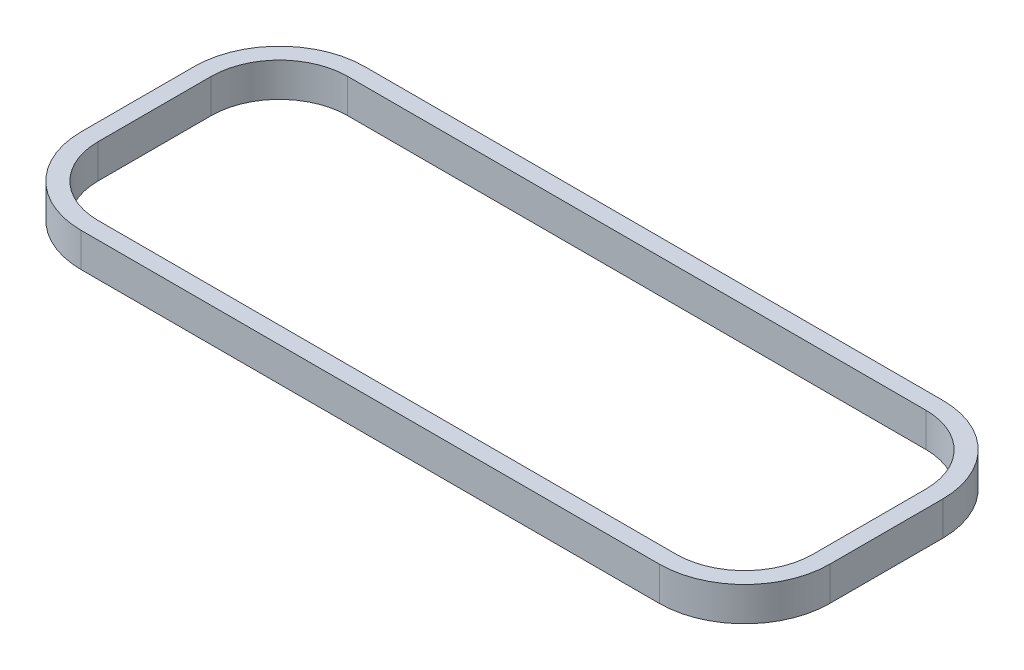
ISO-10303-21;
HEADER;
FILE_DESCRIPTION(('STEP AP214'),'2;1');
FILE_NAME('part.step','',(''),(''),'','','');
FILE_SCHEMA(('AUTOMOTIVE_DESIGN { 1 0 10303 214 1 1 1 1 }'));
ENDSEC;
DATA;
#1=APPLICATION_CONTEXT('core data for automotive mechanical design processes');
#2=APPLICATION_PROTOCOL_DEFINITION('international standard','automotive_design',2000,#1);
#3=PRODUCT_CONTEXT('',#1,'mechanical');
#4=PRODUCT('Part','Part','',(#3));
#5=PRODUCT_RELATED_PRODUCT_CATEGORY('part','',(#4));
#6=PRODUCT_DEFINITION_FORMATION('','',#4);
#7=PRODUCT_DEFINITION_CONTEXT('part definition',#1,'design');
#8=PRODUCT_DEFINITION('design','',#6,#7);
#9=PRODUCT_DEFINITION_SHAPE('','',#8);
#10=(LENGTH_UNIT() NAMED_UNIT(*) SI_UNIT(.MILLI.,.METRE.));
#11=(NAMED_UNIT(*) PLANE_ANGLE_UNIT() SI_UNIT($,.RADIAN.));
#12=(NAMED_UNIT(*) SI_UNIT($,.STERADIAN.) SOLID_ANGLE_UNIT());
#13=UNCERTAINTY_MEASURE_WITH_UNIT(LENGTH_MEASURE(1.E-05),#10,'distance_accuracy_value','');
#14=(GEOMETRIC_REPRESENTATION_CONTEXT(3) GLOBAL_UNCERTAINTY_ASSIGNED_CONTEXT((#13)) GLOBAL_UNIT_ASSIGNED_CONTEXT((#10,
#11,#12)) REPRESENTATION_CONTEXT('',''));
#15=CARTESIAN_POINT('',(0.,0.,0.));
#16=DIRECTION('',(0.,0.,1.));
#17=DIRECTION('',(1.,0.,0.));
#18=AXIS2_PLACEMENT_3D('',#15,#16,#17);
#19=CARTESIAN_POINT('',(-113.664063287363,19.05,-5.18142409919167));
#20=DIRECTION('',(0.,-1.,0.));
#21=DIRECTION('',(0.,0.,-1.));
#22=AXIS2_PLACEMENT_3D('',#19,#20,#21);
#23=PLANE('',#22);
#24=CARTESIAN_POINT('',(-113.664063287363,19.05,-5.18142409919167));
#25=DIRECTION('',(0.,1.,0.));
#26=DIRECTION('',(0.,0.,-1.));
#27=AXIS2_PLACEMENT_3D('',#24,#25,#26);
#28=CIRCLE('',#27,47.752);
#29=CARTESIAN_POINT('',(-113.664063287363,19.05,-52.9334240991916));
#30=VERTEX_POINT('',#29);
#31=CARTESIAN_POINT('',(-161.416063287363,19.05,-5.18142409919167));
#32=VERTEX_POINT('',#31);
#33=EDGE_CURVE('E213',#30,#32,#28,.T.);
#34=ORIENTED_EDGE('',*,*,#33,.T.);
#35=DIRECTION('',(0.,0.,1.));
#36=VECTOR('',#35,1.);
#37=CARTESIAN_POINT('',(-161.416063287363,19.05,-5.18142409919167));
#38=LINE('',#37,#36);
#39=CARTESIAN_POINT('',(-161.416063287363,19.05,58.0645759008083));
#40=VERTEX_POINT('',#39);
#41=EDGE_CURVE('E216',#32,#40,#38,.T.);
#42=ORIENTED_EDGE('',*,*,#41,.T.);
#43=CARTESIAN_POINT('',(-113.664063287363,19.05,58.0645759008084));
#44=DIRECTION('',(0.,1.,0.));
#45=DIRECTION('',(0.,0.,1.));
#46=AXIS2_PLACEMENT_3D('',#43,#44,#45);
#47=CIRCLE('',#46,47.752);
#48=CARTESIAN_POINT('',(-113.664063287363,19.05,105.816575900808));
#49=VERTEX_POINT('',#48);
#50=EDGE_CURVE('E219',#40,#49,#47,.T.);
#51=ORIENTED_EDGE('',*,*,#50,.T.);
#52=DIRECTION('',(1.,0.,0.));
#53=VECTOR('',#52,1.);
#54=CARTESIAN_POINT('',(-113.664063287363,19.05,105.816575900808));
#55=LINE('',#54,#53);
#56=CARTESIAN_POINT('',(209.931936712637,19.05,105.816575900808));
#57=VERTEX_POINT('',#56);
#58=EDGE_CURVE('E221',#49,#57,#55,.T.);
#59=ORIENTED_EDGE('',*,*,#58,.T.);
#60=CARTESIAN_POINT('',(209.931936712637,19.05,58.0645759008083));
#61=DIRECTION('',(0.,1.,0.));
#62=DIRECTION('',(0.,0.,1.));
#63=AXIS2_PLACEMENT_3D('',#60,#61,#62);
#64=CIRCLE('',#63,47.752);
#65=CARTESIAN_POINT('',(257.683936712637,19.05,58.0645759008083));
#66=VERTEX_POINT('',#65);
#67=EDGE_CURVE('E223',#57,#66,#64,.T.);
#68=ORIENTED_EDGE('',*,*,#67,.T.);
#69=DIRECTION('',(0.,0.,-1.));
#70=VECTOR('',#69,1.);
#71=CARTESIAN_POINT('',(257.683936712637,19.05,58.0645759008083));
#72=LINE('',#71,#70);
#73=CARTESIAN_POINT('',(257.683936712636,19.05,-5.18142409919173));
#74=VERTEX_POINT('',#73);
#75=EDGE_CURVE('E225',#66,#74,#72,.T.);
#76=ORIENTED_EDGE('',*,*,#75,.T.);
#77=CARTESIAN_POINT('',(209.931936712636,19.05,-5.1814240991917));
#78=DIRECTION('',(0.,1.,0.));
#79=DIRECTION('',(0.,0.,1.));
#80=AXIS2_PLACEMENT_3D('',#77,#78,#79);
#81=CIRCLE('',#80,47.752);
#82=CARTESIAN_POINT('',(209.931936712636,19.05,-52.9334240991917));
#83=VERTEX_POINT('',#82);
#84=EDGE_CURVE('E227',#74,#83,#81,.T.);
#85=ORIENTED_EDGE('',*,*,#84,.T.);
#86=DIRECTION('',(-1.,0.,0.));
#87=VECTOR('',#86,1.);
#88=CARTESIAN_POINT('',(209.931936712636,19.05,-52.9334240991917));
#89=LINE('',#88,#87);
#90=EDGE_CURVE('E229',#83,#30,#89,.T.);
#91=ORIENTED_EDGE('',*,*,#90,.T.);
#92=EDGE_LOOP('',(#34,#42,#51,#59,#68,#76,#85,#91));
#93=FACE_BOUND('',#92,.T.);
#94=CARTESIAN_POINT('',(-113.664063287363,19.05,-5.18142409919166));
#95=DIRECTION('',(0.,1.,0.));
#96=DIRECTION('',(0.,0.,1.));
#97=AXIS2_PLACEMENT_3D('',#94,#95,#96);
#98=CIRCLE('',#97,38.227);
#99=CARTESIAN_POINT('',(-113.664063287363,19.05,-43.4084240991916));
#100=VERTEX_POINT('',#99);
#101=CARTESIAN_POINT('',(-151.891063287363,19.05,-5.18142409919167));
#102=VERTEX_POINT('',#101);
#103=EDGE_CURVE('E148',#100,#102,#98,.T.);
#104=ORIENTED_EDGE('',*,*,#103,.F.);
#105=DIRECTION('',(-1.,0.,0.));
#106=VECTOR('',#105,1.);
#107=CARTESIAN_POINT('',(209.931936712636,19.05,-43.4084240991917));
#108=LINE('',#107,#106);
#109=CARTESIAN_POINT('',(209.931936712637,19.05,-43.4084240991917));
#110=VERTEX_POINT('',#109);
#111=EDGE_CURVE('E181',#110,#100,#108,.T.);
#112=ORIENTED_EDGE('',*,*,#111,.F.);
#113=CARTESIAN_POINT('',(209.931936712636,19.05,-5.1814240991917));
#114=DIRECTION('',(0.,1.,0.));
#115=DIRECTION('',(0.,0.,1.));
#116=AXIS2_PLACEMENT_3D('',#113,#114,#115);
#117=CIRCLE('',#116,38.227);
#118=CARTESIAN_POINT('',(248.158936712636,19.05,-5.18142409919172));
#119=VERTEX_POINT('',#118);
#120=EDGE_CURVE('E179',#119,#110,#117,.T.);
#121=ORIENTED_EDGE('',*,*,#120,.F.);
#122=DIRECTION('',(0.,0.,-1.));
#123=VECTOR('',#122,1.);
#124=CARTESIAN_POINT('',(248.158936712636,19.05,58.0645759008083));
#125=LINE('',#124,#123);
#126=CARTESIAN_POINT('',(248.158936712637,19.05,58.0645759008083));
#127=VERTEX_POINT('',#126);
#128=EDGE_CURVE('E177',#127,#119,#125,.T.);
#129=ORIENTED_EDGE('',*,*,#128,.F.);
#130=CARTESIAN_POINT('',(209.931936712637,19.05,58.0645759008083));
#131=DIRECTION('',(0.,1.,0.));
#132=DIRECTION('',(0.,0.,1.));
#133=AXIS2_PLACEMENT_3D('',#130,#131,#132);
#134=CIRCLE('',#133,38.227);
#135=CARTESIAN_POINT('',(209.931936712637,19.05,96.2915759008083));
#136=VERTEX_POINT('',#135);
#137=EDGE_CURVE('E175',#136,#127,#134,.T.);
#138=ORIENTED_EDGE('',*,*,#137,.F.);
#139=DIRECTION('',(1.,0.,0.));
#140=VECTOR('',#139,1.);
#141=CARTESIAN_POINT('',(-113.664063287363,19.05,96.2915759008084));
#142=LINE('',#141,#140);
#143=CARTESIAN_POINT('',(-113.664063287363,19.05,96.2915759008083));
#144=VERTEX_POINT('',#143);
#145=EDGE_CURVE('E171',#144,#136,#142,.T.);
#146=ORIENTED_EDGE('',*,*,#145,.F.);
#147=CARTESIAN_POINT('',(-113.664063287363,19.05,58.0645759008084));
#148=DIRECTION('',(0.,1.,0.));
#149=DIRECTION('',(0.,0.,1.));
#150=AXIS2_PLACEMENT_3D('',#147,#148,#149);
#151=CIRCLE('',#150,38.227);
#152=CARTESIAN_POINT('',(-151.891063287363,19.05,58.0645759008083));
#153=VERTEX_POINT('',#152);
#154=EDGE_CURVE('E169',#153,#144,#151,.T.);
#155=ORIENTED_EDGE('',*,*,#154,.F.);
#156=DIRECTION('',(0.,0.,1.));
#157=VECTOR('',#156,1.);
#158=CARTESIAN_POINT('',(-151.891063287363,19.05,-5.18142409919167));
#159=LINE('',#158,#157);
#160=EDGE_CURVE('E156',#102,#153,#159,.T.);
#161=ORIENTED_EDGE('',*,*,#160,.F.);
#162=EDGE_LOOP('',(#104,#112,#121,#129,#138,#146,#155,#161));
#163=FACE_BOUND('',#162,.T.);
#164=ADVANCED_FACE('F35',(#93,#163),#23,.F.);
#165=CARTESIAN_POINT('',(-113.664063287363,0.,-5.18142409919167));
#166=DIRECTION('',(0.,-1.,0.));
#167=DIRECTION('',(0.,0.,-1.));
#168=AXIS2_PLACEMENT_3D('',#165,#166,#167);
#169=PLANE('',#168);
#170=CARTESIAN_POINT('',(-113.664063287363,0.,-5.18142409919167));
#171=DIRECTION('',(0.,1.,0.));
#172=DIRECTION('',(0.,0.,-1.));
#173=AXIS2_PLACEMENT_3D('',#170,#171,#172);
#174=CIRCLE('',#173,47.752);
#175=CARTESIAN_POINT('',(-113.664063287363,0.,-52.9334240991916));
#176=VERTEX_POINT('',#175);
#177=CARTESIAN_POINT('',(-161.416063287363,0.,-5.18142409919167));
#178=VERTEX_POINT('',#177);
#179=EDGE_CURVE('E164',#176,#178,#174,.T.);
#180=ORIENTED_EDGE('',*,*,#179,.F.);
#181=DIRECTION('',(-1.,0.,0.));
#182=VECTOR('',#181,1.);
#183=CARTESIAN_POINT('',(209.931936712636,0.,-52.9334240991917));
#184=LINE('',#183,#182);
#185=CARTESIAN_POINT('',(209.931936712636,0.,-52.9334240991917));
#186=VERTEX_POINT('',#185);
#187=EDGE_CURVE('E217',#186,#176,#184,.T.);
#188=ORIENTED_EDGE('',*,*,#187,.F.);
#189=CARTESIAN_POINT('',(209.931936712636,0.,-5.1814240991917));
#190=DIRECTION('',(0.,1.,0.));
#191=DIRECTION('',(0.,0.,1.));
#192=AXIS2_PLACEMENT_3D('',#189,#190,#191);
#193=CIRCLE('',#192,47.752);
#194=CARTESIAN_POINT('',(257.683936712636,0.,-5.18142409919173));
#195=VERTEX_POINT('',#194);
#196=EDGE_CURVE('E244',#195,#186,#193,.T.);
#197=ORIENTED_EDGE('',*,*,#196,.F.);
#198=DIRECTION('',(0.,0.,-1.));
#199=VECTOR('',#198,1.);
#200=CARTESIAN_POINT('',(257.683936712637,0.,58.0645759008083));
#201=LINE('',#200,#199);
#202=CARTESIAN_POINT('',(257.683936712637,0.,58.0645759008083));
#203=VERTEX_POINT('',#202);
#204=EDGE_CURVE('E242',#203,#195,#201,.T.);
#205=ORIENTED_EDGE('',*,*,#204,.F.);
#206=CARTESIAN_POINT('',(209.931936712637,0.,58.0645759008083));
#207=DIRECTION('',(0.,1.,0.));
#208=DIRECTION('',(0.,0.,1.));
#209=AXIS2_PLACEMENT_3D('',#206,#207,#208);
#210=CIRCLE('',#209,47.752);
#211=CARTESIAN_POINT('',(209.931936712637,0.,105.816575900808));
#212=VERTEX_POINT('',#211);
#213=EDGE_CURVE('E240',#212,#203,#210,.T.);
#214=ORIENTED_EDGE('',*,*,#213,.F.);
#215=DIRECTION('',(1.,0.,0.));
#216=VECTOR('',#215,1.);
#217=CARTESIAN_POINT('',(-113.664063287363,0.,105.816575900808));
#218=LINE('',#217,#216);
#219=CARTESIAN_POINT('',(-113.664063287363,0.,105.816575900808));
#220=VERTEX_POINT('',#219);
#221=EDGE_CURVE('E238',#220,#212,#218,.T.);
#222=ORIENTED_EDGE('',*,*,#221,.F.);
#223=CARTESIAN_POINT('',(-113.664063287363,0.,58.0645759008084));
#224=DIRECTION('',(0.,1.,0.));
#225=DIRECTION('',(0.,0.,1.));
#226=AXIS2_PLACEMENT_3D('',#223,#224,#225);
#227=CIRCLE('',#226,47.752);
#228=CARTESIAN_POINT('',(-161.416063287363,0.,58.0645759008083));
#229=VERTEX_POINT('',#228);
#230=EDGE_CURVE('E236',#229,#220,#227,.T.);
#231=ORIENTED_EDGE('',*,*,#230,.F.);
#232=DIRECTION('',(0.,0.,1.));
#233=VECTOR('',#232,1.);
#234=CARTESIAN_POINT('',(-161.416063287363,0.,-5.18142409919167));
#235=LINE('',#234,#233);
#236=EDGE_CURVE('E234',#178,#229,#235,.T.);
#237=ORIENTED_EDGE('',*,*,#236,.F.);
#238=EDGE_LOOP('',(#180,#188,#197,#205,#214,#222,#231,#237));
#239=FACE_BOUND('',#238,.T.);
#240=DIRECTION('',(-1.,0.,0.));
#241=VECTOR('',#240,1.);
#242=CARTESIAN_POINT('',(209.931936712636,0.,-43.4084240991917));
#243=LINE('',#242,#241);
#244=CARTESIAN_POINT('',(209.931936712636,0.,-43.4084240991917));
#245=VERTEX_POINT('',#244);
#246=CARTESIAN_POINT('',(-113.664063287363,0.,-43.4084240991916));
#247=VERTEX_POINT('',#246);
#248=EDGE_CURVE('E157',#245,#247,#243,.T.);
#249=ORIENTED_EDGE('',*,*,#248,.T.);
#250=CARTESIAN_POINT('',(-113.664063287363,0.,-5.18142409919166));
#251=DIRECTION('',(0.,1.,0.));
#252=DIRECTION('',(0.,0.,1.));
#253=AXIS2_PLACEMENT_3D('',#250,#251,#252);
#254=CIRCLE('',#253,38.227);
#255=CARTESIAN_POINT('',(-151.891063287363,0.,-5.18142409919167));
#256=VERTEX_POINT('',#255);
#257=EDGE_CURVE('E58',#247,#256,#254,.T.);
#258=ORIENTED_EDGE('',*,*,#257,.T.);
#259=DIRECTION('',(0.,0.,1.));
#260=VECTOR('',#259,1.);
#261=CARTESIAN_POINT('',(-151.891063287363,0.,-5.18142409919167));
#262=LINE('',#261,#260);
#263=CARTESIAN_POINT('',(-151.891063287363,0.,58.0645759008083));
#264=VERTEX_POINT('',#263);
#265=EDGE_CURVE('E163',#256,#264,#262,.T.);
#266=ORIENTED_EDGE('',*,*,#265,.T.);
#267=CARTESIAN_POINT('',(-113.664063287363,0.,58.0645759008084));
#268=DIRECTION('',(0.,1.,0.));
#269=DIRECTION('',(0.,0.,1.));
#270=AXIS2_PLACEMENT_3D('',#267,#268,#269);
#271=CIRCLE('',#270,38.227);
#272=CARTESIAN_POINT('',(-113.664063287363,0.,96.2915759008083));
#273=VERTEX_POINT('',#272);
#274=EDGE_CURVE('E185',#264,#273,#271,.T.);
#275=ORIENTED_EDGE('',*,*,#274,.T.);
#276=DIRECTION('',(1.,0.,0.));
#277=VECTOR('',#276,1.);
#278=CARTESIAN_POINT('',(-113.664063287363,0.,96.2915759008084));
#279=LINE('',#278,#277);
#280=CARTESIAN_POINT('',(209.931936712637,0.,96.2915759008083));
#281=VERTEX_POINT('',#280);
#282=EDGE_CURVE('E188',#273,#281,#279,.T.);
#283=ORIENTED_EDGE('',*,*,#282,.T.);
#284=CARTESIAN_POINT('',(209.931936712637,0.,58.0645759008083));
#285=DIRECTION('',(0.,1.,0.));
#286=DIRECTION('',(0.,0.,1.));
#287=AXIS2_PLACEMENT_3D('',#284,#285,#286);
#288=CIRCLE('',#287,38.227);
#289=CARTESIAN_POINT('',(248.158936712637,0.,58.0645759008083));
#290=VERTEX_POINT('',#289);
#291=EDGE_CURVE('E191',#281,#290,#288,.T.);
#292=ORIENTED_EDGE('',*,*,#291,.T.);
#293=DIRECTION('',(0.,0.,-1.));
#294=VECTOR('',#293,1.);
#295=CARTESIAN_POINT('',(248.158936712636,0.,58.0645759008083));
#296=LINE('',#295,#294);
#297=CARTESIAN_POINT('',(248.158936712636,0.,-5.18142409919172));
#298=VERTEX_POINT('',#297);
#299=EDGE_CURVE('E194',#290,#298,#296,.T.);
#300=ORIENTED_EDGE('',*,*,#299,.T.);
#301=CARTESIAN_POINT('',(209.931936712636,0.,-5.1814240991917));
#302=DIRECTION('',(0.,1.,0.));
#303=DIRECTION('',(0.,0.,1.));
#304=AXIS2_PLACEMENT_3D('',#301,#302,#303);
#305=CIRCLE('',#304,38.227);
#306=EDGE_CURVE('E197',#298,#245,#305,.T.);
#307=ORIENTED_EDGE('',*,*,#306,.T.);
#308=EDGE_LOOP('',(#249,#258,#266,#275,#283,#292,#300,#307));
#309=FACE_BOUND('',#308,.T.);
#310=ADVANCED_FACE('F274',(#239,#309),#169,.T.);
#311=CARTESIAN_POINT('',(-113.664063287363,19.05,-5.18142409919167));
#312=DIRECTION('',(0.,-1.,0.));
#313=DIRECTION('',(0.,0.,-1.));
#314=AXIS2_PLACEMENT_3D('',#311,#312,#313);
#315=CYLINDRICAL_SURFACE('',#314,47.752);
#316=ORIENTED_EDGE('',*,*,#179,.T.);
#317=DIRECTION('',(0.,-1.,0.));
#318=VECTOR('',#317,1.);
#319=CARTESIAN_POINT('',(-161.416063287363,19.05,-5.18142409919167));
#320=LINE('',#319,#318);
#321=EDGE_CURVE('E11',#32,#178,#320,.T.);
#322=ORIENTED_EDGE('',*,*,#321,.F.);
#323=ORIENTED_EDGE('',*,*,#33,.F.);
#324=DIRECTION('',(0.,-1.,0.));
#325=VECTOR('',#324,1.);
#326=CARTESIAN_POINT('',(-113.664063287363,19.05,-52.9334240991916));
#327=LINE('',#326,#325);
#328=EDGE_CURVE('E231',#30,#176,#327,.T.);
#329=ORIENTED_EDGE('',*,*,#328,.T.);
#330=EDGE_LOOP('',(#316,#322,#323,#329));
#331=FACE_BOUND('',#330,.T.);
#332=ADVANCED_FACE('F37',(#331),#315,.T.);
#333=CARTESIAN_POINT('',(-161.416063287363,19.05,-5.18142409919167));
#334=DIRECTION('',(1.,0.,0.));
#335=DIRECTION('',(0.,0.,-1.));
#336=AXIS2_PLACEMENT_3D('',#333,#334,#335);
#337=PLANE('',#336);
#338=ORIENTED_EDGE('',*,*,#236,.T.);
#339=DIRECTION('',(0.,-1.,0.));
#340=VECTOR('',#339,1.);
#341=CARTESIAN_POINT('',(-161.416063287363,19.05,58.0645759008083));
#342=LINE('',#341,#340);
#343=EDGE_CURVE('E43',#40,#229,#342,.T.);
#344=ORIENTED_EDGE('',*,*,#343,.F.);
#345=ORIENTED_EDGE('',*,*,#41,.F.);
#346=ORIENTED_EDGE('',*,*,#321,.T.);
#347=EDGE_LOOP('',(#338,#344,#345,#346));
#348=FACE_BOUND('',#347,.T.);
#349=ADVANCED_FACE('F291',(#348),#337,.F.);
#350=CARTESIAN_POINT('',(-113.664063287363,19.05,58.0645759008084));
#351=DIRECTION('',(0.,-1.,0.));
#352=DIRECTION('',(0.,0.,-1.));
#353=AXIS2_PLACEMENT_3D('',#350,#351,#352);
#354=CYLINDRICAL_SURFACE('',#353,47.752);
#355=ORIENTED_EDGE('',*,*,#230,.T.);
#356=DIRECTION('',(0.,-1.,0.));
#357=VECTOR('',#356,1.);
#358=CARTESIAN_POINT('',(-113.664063287363,19.05,105.816575900808));
#359=LINE('',#358,#357);
#360=EDGE_CURVE('E261',#49,#220,#359,.T.);
#361=ORIENTED_EDGE('',*,*,#360,.F.);
#362=ORIENTED_EDGE('',*,*,#50,.F.);
#363=ORIENTED_EDGE('',*,*,#343,.T.);
#364=EDGE_LOOP('',(#355,#361,#362,#363));
#365=FACE_BOUND('',#364,.T.);
#366=ADVANCED_FACE('F268',(#365),#354,.T.);
#367=CARTESIAN_POINT('',(-113.664063287363,19.05,105.816575900808));
#368=DIRECTION('',(0.,0.,-1.));
#369=DIRECTION('',(-1.,0.,0.));
#370=AXIS2_PLACEMENT_3D('',#367,#368,#369);
#371=PLANE('',#370);
#372=ORIENTED_EDGE('',*,*,#221,.T.);
#373=DIRECTION('',(0.,-1.,0.));
#374=VECTOR('',#373,1.);
#375=CARTESIAN_POINT('',(209.931936712637,19.05,105.816575900808));
#376=LINE('',#375,#374);
#377=EDGE_CURVE('E258',#57,#212,#376,.T.);
#378=ORIENTED_EDGE('',*,*,#377,.F.);
#379=ORIENTED_EDGE('',*,*,#58,.F.);
#380=ORIENTED_EDGE('',*,*,#360,.T.);
#381=EDGE_LOOP('',(#372,#378,#379,#380));
#382=FACE_BOUND('',#381,.T.);
#383=ADVANCED_FACE('F280',(#382),#371,.F.);
#384=CARTESIAN_POINT('',(209.931936712637,19.05,58.0645759008083));
#385=DIRECTION('',(0.,-1.,0.));
#386=DIRECTION('',(0.,0.,-1.));
#387=AXIS2_PLACEMENT_3D('',#384,#385,#386);
#388=CYLINDRICAL_SURFACE('',#387,47.752);
#389=ORIENTED_EDGE('',*,*,#213,.T.);
#390=DIRECTION('',(0.,-1.,0.));
#391=VECTOR('',#390,1.);
#392=CARTESIAN_POINT('',(257.683936712637,19.05,58.0645759008083));
#393=LINE('',#392,#391);
#394=EDGE_CURVE('E255',#66,#203,#393,.T.);
#395=ORIENTED_EDGE('',*,*,#394,.F.);
#396=ORIENTED_EDGE('',*,*,#67,.F.);
#397=ORIENTED_EDGE('',*,*,#377,.T.);
#398=EDGE_LOOP('',(#389,#395,#396,#397));
#399=FACE_BOUND('',#398,.T.);
#400=ADVANCED_FACE('F284',(#399),#388,.T.);
#401=CARTESIAN_POINT('',(257.683936712637,19.05,58.0645759008083));
#402=DIRECTION('',(-1.,0.,0.));
#403=DIRECTION('',(0.,0.,1.));
#404=AXIS2_PLACEMENT_3D('',#401,#402,#403);
#405=PLANE('',#404);
#406=ORIENTED_EDGE('',*,*,#204,.T.);
#407=DIRECTION('',(0.,-1.,0.));
#408=VECTOR('',#407,1.);
#409=CARTESIAN_POINT('',(257.683936712636,19.05,-5.18142409919173));
#410=LINE('',#409,#408);
#411=EDGE_CURVE('E252',#74,#195,#410,.T.);
#412=ORIENTED_EDGE('',*,*,#411,.F.);
#413=ORIENTED_EDGE('',*,*,#75,.F.);
#414=ORIENTED_EDGE('',*,*,#394,.T.);
#415=EDGE_LOOP('',(#406,#412,#413,#414));
#416=FACE_BOUND('',#415,.T.);
#417=ADVANCED_FACE('F304',(#416),#405,.F.);
#418=CARTESIAN_POINT('',(209.931936712636,19.05,-5.1814240991917));
#419=DIRECTION('',(0.,-1.,0.));
#420=DIRECTION('',(0.,0.,-1.));
#421=AXIS2_PLACEMENT_3D('',#418,#419,#420);
#422=CYLINDRICAL_SURFACE('',#421,47.752);
#423=ORIENTED_EDGE('',*,*,#196,.T.);
#424=DIRECTION('',(0.,-1.,0.));
#425=VECTOR('',#424,1.);
#426=CARTESIAN_POINT('',(209.931936712636,19.05,-52.9334240991917));
#427=LINE('',#426,#425);
#428=EDGE_CURVE('E249',#83,#186,#427,.T.);
#429=ORIENTED_EDGE('',*,*,#428,.F.);
#430=ORIENTED_EDGE('',*,*,#84,.F.);
#431=ORIENTED_EDGE('',*,*,#411,.T.);
#432=EDGE_LOOP('',(#423,#429,#430,#431));
#433=FACE_BOUND('',#432,.T.);
#434=ADVANCED_FACE('F302',(#433),#422,.T.);
#435=CARTESIAN_POINT('',(209.931936712636,19.05,-52.9334240991917));
#436=DIRECTION('',(0.,0.,1.));
#437=DIRECTION('',(1.,0.,0.));
#438=AXIS2_PLACEMENT_3D('',#435,#436,#437);
#439=PLANE('',#438);
#440=ORIENTED_EDGE('',*,*,#187,.T.);
#441=ORIENTED_EDGE('',*,*,#328,.F.);
#442=ORIENTED_EDGE('',*,*,#90,.F.);
#443=ORIENTED_EDGE('',*,*,#428,.T.);
#444=EDGE_LOOP('',(#440,#441,#442,#443));
#445=FACE_BOUND('',#444,.T.);
#446=ADVANCED_FACE('F297',(#445),#439,.F.);
#447=CARTESIAN_POINT('',(-113.664063287363,19.05,-5.18142409919166));
#448=DIRECTION('',(0.,-1.,0.));
#449=DIRECTION('',(0.,0.,-1.));
#450=AXIS2_PLACEMENT_3D('',#447,#448,#449);
#451=CYLINDRICAL_SURFACE('',#450,38.227);
#452=ORIENTED_EDGE('',*,*,#257,.F.);
#453=DIRECTION('',(0.,-1.,0.));
#454=VECTOR('',#453,1.);
#455=CARTESIAN_POINT('',(-113.664063287363,19.05,-43.4084240991916));
#456=LINE('',#455,#454);
#457=EDGE_CURVE('E152',#100,#247,#456,.T.);
#458=ORIENTED_EDGE('',*,*,#457,.F.);
#459=ORIENTED_EDGE('',*,*,#103,.T.);
#460=DIRECTION('',(0.,-1.,0.));
#461=VECTOR('',#460,1.);
#462=CARTESIAN_POINT('',(-151.891063287363,19.05,-5.18142409919167));
#463=LINE('',#462,#461);
#464=EDGE_CURVE('E151',#102,#256,#463,.T.);
#465=ORIENTED_EDGE('',*,*,#464,.T.);
#466=EDGE_LOOP('',(#452,#458,#459,#465));
#467=FACE_BOUND('',#466,.T.);
#468=ADVANCED_FACE('F150',(#467),#451,.F.);
#469=CARTESIAN_POINT('',(-151.891063287363,19.05,-5.18142409919167));
#470=DIRECTION('',(1.,0.,0.));
#471=DIRECTION('',(0.,0.,-1.));
#472=AXIS2_PLACEMENT_3D('',#469,#470,#471);
#473=PLANE('',#472);
#474=ORIENTED_EDGE('',*,*,#265,.F.);
#475=ORIENTED_EDGE('',*,*,#464,.F.);
#476=ORIENTED_EDGE('',*,*,#160,.T.);
#477=DIRECTION('',(0.,-1.,0.));
#478=VECTOR('',#477,1.);
#479=CARTESIAN_POINT('',(-151.891063287363,19.05,58.0645759008083));
#480=LINE('',#479,#478);
#481=EDGE_CURVE('E165',#153,#264,#480,.T.);
#482=ORIENTED_EDGE('',*,*,#481,.T.);
#483=EDGE_LOOP('',(#474,#475,#476,#482));
#484=FACE_BOUND('',#483,.T.);
#485=ADVANCED_FACE('F160',(#484),#473,.T.);
#486=CARTESIAN_POINT('',(-113.664063287363,19.05,58.0645759008084));
#487=DIRECTION('',(0.,-1.,0.));
#488=DIRECTION('',(0.,0.,-1.));
#489=AXIS2_PLACEMENT_3D('',#486,#487,#488);
#490=CYLINDRICAL_SURFACE('',#489,38.227);
#491=ORIENTED_EDGE('',*,*,#274,.F.);
#492=ORIENTED_EDGE('',*,*,#481,.F.);
#493=ORIENTED_EDGE('',*,*,#154,.T.);
#494=DIRECTION('',(0.,-1.,0.));
#495=VECTOR('',#494,1.);
#496=CARTESIAN_POINT('',(-113.664063287363,19.05,96.2915759008083));
#497=LINE('',#496,#495);
#498=EDGE_CURVE('E210',#144,#273,#497,.T.);
#499=ORIENTED_EDGE('',*,*,#498,.T.);
#500=EDGE_LOOP('',(#491,#492,#493,#499));
#501=FACE_BOUND('',#500,.T.);
#502=ADVANCED_FACE('F329',(#501),#490,.F.);
#503=CARTESIAN_POINT('',(-113.664063287363,19.05,96.2915759008084));
#504=DIRECTION('',(0.,0.,-1.));
#505=DIRECTION('',(-1.,0.,0.));
#506=AXIS2_PLACEMENT_3D('',#503,#504,#505);
#507=PLANE('',#506);
#508=ORIENTED_EDGE('',*,*,#282,.F.);
#509=ORIENTED_EDGE('',*,*,#498,.F.);
#510=ORIENTED_EDGE('',*,*,#145,.T.);
#511=DIRECTION('',(0.,-1.,0.));
#512=VECTOR('',#511,1.);
#513=CARTESIAN_POINT('',(209.931936712637,19.05,96.2915759008083));
#514=LINE('',#513,#512);
#515=EDGE_CURVE('E208',#136,#281,#514,.T.);
#516=ORIENTED_EDGE('',*,*,#515,.T.);
#517=EDGE_LOOP('',(#508,#509,#510,#516));
#518=FACE_BOUND('',#517,.T.);
#519=ADVANCED_FACE('F333',(#518),#507,.T.);
#520=CARTESIAN_POINT('',(209.931936712637,19.05,58.0645759008083));
#521=DIRECTION('',(0.,-1.,0.));
#522=DIRECTION('',(0.,0.,-1.));
#523=AXIS2_PLACEMENT_3D('',#520,#521,#522);
#524=CYLINDRICAL_SURFACE('',#523,38.227);
#525=ORIENTED_EDGE('',*,*,#291,.F.);
#526=ORIENTED_EDGE('',*,*,#515,.F.);
#527=ORIENTED_EDGE('',*,*,#137,.T.);
#528=DIRECTION('',(0.,-1.,0.));
#529=VECTOR('',#528,1.);
#530=CARTESIAN_POINT('',(248.158936712637,19.05,58.0645759008083));
#531=LINE('',#530,#529);
#532=EDGE_CURVE('E206',#127,#290,#531,.T.);
#533=ORIENTED_EDGE('',*,*,#532,.T.);
#534=EDGE_LOOP('',(#525,#526,#527,#533));
#535=FACE_BOUND('',#534,.T.);
#536=ADVANCED_FACE('F339',(#535),#524,.F.);
#537=CARTESIAN_POINT('',(248.158936712636,19.05,58.0645759008083));
#538=DIRECTION('',(-1.,0.,0.));
#539=DIRECTION('',(0.,0.,1.));
#540=AXIS2_PLACEMENT_3D('',#537,#538,#539);
#541=PLANE('',#540);
#542=ORIENTED_EDGE('',*,*,#299,.F.);
#543=ORIENTED_EDGE('',*,*,#532,.F.);
#544=ORIENTED_EDGE('',*,*,#128,.T.);
#545=DIRECTION('',(0.,-1.,0.));
#546=VECTOR('',#545,1.);
#547=CARTESIAN_POINT('',(248.158936712636,19.05,-5.18142409919172));
#548=LINE('',#547,#546);
#549=EDGE_CURVE('E204',#119,#298,#548,.T.);
#550=ORIENTED_EDGE('',*,*,#549,.T.);
#551=EDGE_LOOP('',(#542,#543,#544,#550));
#552=FACE_BOUND('',#551,.T.);
#553=ADVANCED_FACE('F343',(#552),#541,.T.);
#554=CARTESIAN_POINT('',(209.931936712636,19.05,-5.1814240991917));
#555=DIRECTION('',(0.,-1.,0.));
#556=DIRECTION('',(0.,0.,-1.));
#557=AXIS2_PLACEMENT_3D('',#554,#555,#556);
#558=CYLINDRICAL_SURFACE('',#557,38.227);
#559=ORIENTED_EDGE('',*,*,#306,.F.);
#560=ORIENTED_EDGE('',*,*,#549,.F.);
#561=ORIENTED_EDGE('',*,*,#120,.T.);
#562=DIRECTION('',(0.,-1.,0.));
#563=VECTOR('',#562,1.);
#564=CARTESIAN_POINT('',(209.931936712636,19.05,-43.4084240991917));
#565=LINE('',#564,#563);
#566=EDGE_CURVE('E50',#110,#245,#565,.T.);
#567=ORIENTED_EDGE('',*,*,#566,.T.);
#568=EDGE_LOOP('',(#559,#560,#561,#567));
#569=FACE_BOUND('',#568,.T.);
#570=ADVANCED_FACE('F347',(#569),#558,.F.);
#571=CARTESIAN_POINT('',(209.931936712636,19.05,-43.4084240991917));
#572=DIRECTION('',(0.,0.,1.));
#573=DIRECTION('',(1.,0.,0.));
#574=AXIS2_PLACEMENT_3D('',#571,#572,#573);
#575=PLANE('',#574);
#576=ORIENTED_EDGE('',*,*,#248,.F.);
#577=ORIENTED_EDGE('',*,*,#566,.F.);
#578=ORIENTED_EDGE('',*,*,#111,.T.);
#579=ORIENTED_EDGE('',*,*,#457,.T.);
#580=EDGE_LOOP('',(#576,#577,#578,#579));
#581=FACE_BOUND('',#580,.T.);
#582=ADVANCED_FACE('F351',(#581),#575,.T.);
#583=CLOSED_SHELL('',(#164,#310,#332,#349,#366,#383,#400,#417,#434,#446,#468,#485,#502,#519,
#536,#553,#570,#582));
#584=MANIFOLD_SOLID_BREP('B2',#583);
#585=ADVANCED_BREP_SHAPE_REPRESENTATION('',(#18,#584),#14);
#586=SHAPE_DEFINITION_REPRESENTATION(#9,#585);
ENDSEC;
END-ISO-10303-21;
